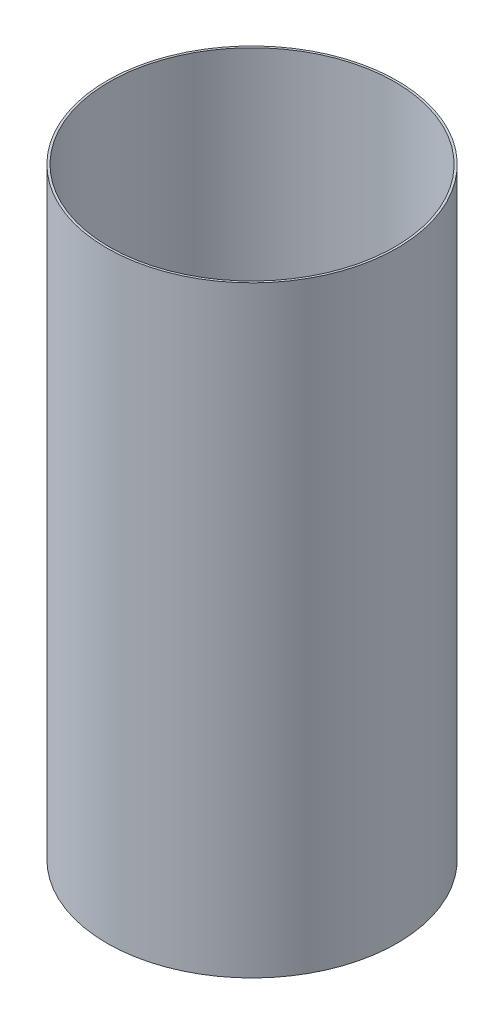
ISO-10303-21;
HEADER;
FILE_DESCRIPTION(('STEP AP214'),'2;1');
FILE_NAME('part.step','',(''),(''),'','','');
FILE_SCHEMA(('AUTOMOTIVE_DESIGN { 1 0 10303 214 1 1 1 1 }'));
ENDSEC;
DATA;
#1=APPLICATION_CONTEXT('core data for automotive mechanical design processes');
#2=APPLICATION_PROTOCOL_DEFINITION('international standard','automotive_design',2000,#1);
#3=PRODUCT_CONTEXT('',#1,'mechanical');
#4=PRODUCT('Part','Part','',(#3));
#5=PRODUCT_RELATED_PRODUCT_CATEGORY('part','',(#4));
#6=PRODUCT_DEFINITION_FORMATION('','',#4);
#7=PRODUCT_DEFINITION_CONTEXT('part definition',#1,'design');
#8=PRODUCT_DEFINITION('design','',#6,#7);
#9=PRODUCT_DEFINITION_SHAPE('','',#8);
#10=(LENGTH_UNIT() NAMED_UNIT(*) SI_UNIT(.MILLI.,.METRE.));
#11=(NAMED_UNIT(*) PLANE_ANGLE_UNIT() SI_UNIT($,.RADIAN.));
#12=(NAMED_UNIT(*) SI_UNIT($,.STERADIAN.) SOLID_ANGLE_UNIT());
#13=UNCERTAINTY_MEASURE_WITH_UNIT(LENGTH_MEASURE(1.E-05),#10,'distance_accuracy_value','');
#14=(GEOMETRIC_REPRESENTATION_CONTEXT(3) GLOBAL_UNCERTAINTY_ASSIGNED_CONTEXT((#13)) GLOBAL_UNIT_ASSIGNED_CONTEXT((#10,
#11,#12)) REPRESENTATION_CONTEXT('',''));
#15=CARTESIAN_POINT('',(0.,0.,0.));
#16=DIRECTION('',(0.,0.,1.));
#17=DIRECTION('',(1.,0.,0.));
#18=AXIS2_PLACEMENT_3D('',#15,#16,#17);
#19=CARTESIAN_POINT('',(0.,150.,0.));
#20=DIRECTION('',(0.,1.,0.));
#21=DIRECTION('',(0.,0.,1.));
#22=AXIS2_PLACEMENT_3D('',#19,#20,#21);
#23=PLANE('',#22);
#24=CARTESIAN_POINT('',(0.,150.,0.));
#25=DIRECTION('',(0.,1.,0.));
#26=DIRECTION('',(0.,0.,1.));
#27=AXIS2_PLACEMENT_3D('',#24,#25,#26);
#28=CIRCLE('',#27,36.15);
#29=CARTESIAN_POINT('',(0.,150.,36.15));
#30=VERTEX_POINT('',#29);
#31=EDGE_CURVE('E10',#30,#30,#28,.T.);
#32=ORIENTED_EDGE('',*,*,#31,.T.);
#33=EDGE_LOOP('',(#32));
#34=FACE_BOUND('',#33,.T.);
#35=CARTESIAN_POINT('',(0.,150.,0.));
#36=DIRECTION('',(0.,1.,0.));
#37=DIRECTION('',(0.,0.,1.));
#38=AXIS2_PLACEMENT_3D('',#35,#36,#37);
#39=CIRCLE('',#38,35.605);
#40=CARTESIAN_POINT('',(0.,150.,35.605));
#41=VERTEX_POINT('',#40);
#42=EDGE_CURVE('E46',#41,#41,#39,.T.);
#43=ORIENTED_EDGE('',*,*,#42,.F.);
#44=EDGE_LOOP('',(#43));
#45=FACE_BOUND('',#44,.T.);
#46=ADVANCED_FACE('F35',(#34,#45),#23,.T.);
#47=CARTESIAN_POINT('',(0.,0.,0.));
#48=DIRECTION('',(0.,1.,0.));
#49=DIRECTION('',(0.,0.,1.));
#50=AXIS2_PLACEMENT_3D('',#47,#48,#49);
#51=PLANE('',#50);
#52=CARTESIAN_POINT('',(0.,0.,0.));
#53=DIRECTION('',(0.,1.,0.));
#54=DIRECTION('',(0.,0.,1.));
#55=AXIS2_PLACEMENT_3D('',#52,#53,#54);
#56=CIRCLE('',#55,36.15);
#57=CARTESIAN_POINT('',(0.,0.,36.15));
#58=VERTEX_POINT('',#57);
#59=EDGE_CURVE('E39',#58,#58,#56,.T.);
#60=ORIENTED_EDGE('',*,*,#59,.F.);
#61=EDGE_LOOP('',(#60));
#62=FACE_BOUND('',#61,.T.);
#63=CARTESIAN_POINT('',(0.,0.,0.));
#64=DIRECTION('',(0.,1.,0.));
#65=DIRECTION('',(0.,0.,1.));
#66=AXIS2_PLACEMENT_3D('',#63,#64,#65);
#67=CIRCLE('',#66,35.605);
#68=CARTESIAN_POINT('',(0.,0.,35.605));
#69=VERTEX_POINT('',#68);
#70=EDGE_CURVE('E48',#69,#69,#67,.T.);
#71=ORIENTED_EDGE('',*,*,#70,.T.);
#72=EDGE_LOOP('',(#71));
#73=FACE_BOUND('',#72,.T.);
#74=ADVANCED_FACE('F58',(#62,#73),#51,.F.);
#75=CARTESIAN_POINT('',(0.,150.,0.));
#76=DIRECTION('',(0.,-1.,0.));
#77=DIRECTION('',(0.,0.,-1.));
#78=AXIS2_PLACEMENT_3D('',#75,#76,#77);
#79=CYLINDRICAL_SURFACE('',#78,36.15);
#80=ORIENTED_EDGE('',*,*,#31,.F.);
#81=EDGE_LOOP('',(#80));
#82=FACE_BOUND('',#81,.T.);
#83=ORIENTED_EDGE('',*,*,#59,.T.);
#84=EDGE_LOOP('',(#83));
#85=FACE_BOUND('',#84,.T.);
#86=ADVANCED_FACE('F37',(#82,#85),#79,.T.);
#87=CARTESIAN_POINT('',(0.,150.,0.));
#88=DIRECTION('',(0.,-1.,0.));
#89=DIRECTION('',(0.,0.,-1.));
#90=AXIS2_PLACEMENT_3D('',#87,#88,#89);
#91=CYLINDRICAL_SURFACE('',#90,35.605);
#92=ORIENTED_EDGE('',*,*,#42,.T.);
#93=EDGE_LOOP('',(#92));
#94=FACE_BOUND('',#93,.T.);
#95=ORIENTED_EDGE('',*,*,#70,.F.);
#96=EDGE_LOOP('',(#95));
#97=FACE_BOUND('',#96,.T.);
#98=ADVANCED_FACE('F54',(#94,#97),#91,.F.);
#99=CLOSED_SHELL('',(#46,#74,#86,#98));
#100=MANIFOLD_SOLID_BREP('B2',#99);
#101=ADVANCED_BREP_SHAPE_REPRESENTATION('',(#18,#100),#14);
#102=SHAPE_DEFINITION_REPRESENTATION(#9,#101);
ENDSEC;
END-ISO-10303-21;
